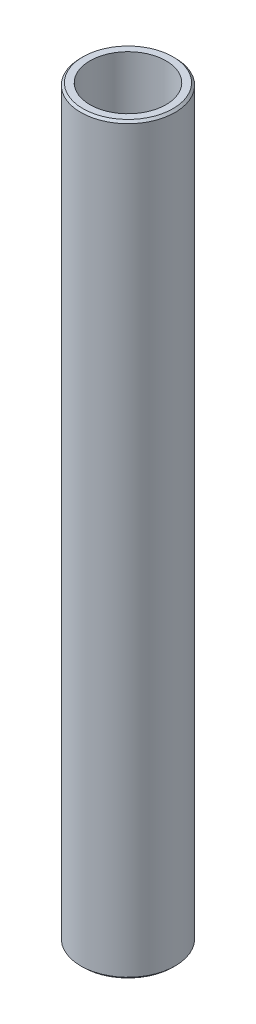
ISO-10303-21;
HEADER;
FILE_DESCRIPTION(('STEP AP214'),'2;1');
FILE_NAME('part.step','',(''),(''),'','','');
FILE_SCHEMA(('AUTOMOTIVE_DESIGN { 1 0 10303 214 1 1 1 1 }'));
ENDSEC;
DATA;
#1=APPLICATION_CONTEXT('core data for automotive mechanical design processes');
#2=APPLICATION_PROTOCOL_DEFINITION('international standard','automotive_design',2000,#1);
#3=PRODUCT_CONTEXT('',#1,'mechanical');
#4=PRODUCT('Part','Part','',(#3));
#5=PRODUCT_RELATED_PRODUCT_CATEGORY('part','',(#4));
#6=PRODUCT_DEFINITION_FORMATION('','',#4);
#7=PRODUCT_DEFINITION_CONTEXT('part definition',#1,'design');
#8=PRODUCT_DEFINITION('design','',#6,#7);
#9=PRODUCT_DEFINITION_SHAPE('','',#8);
#10=(LENGTH_UNIT() NAMED_UNIT(*) SI_UNIT(.MILLI.,.METRE.));
#11=(NAMED_UNIT(*) PLANE_ANGLE_UNIT() SI_UNIT($,.RADIAN.));
#12=(NAMED_UNIT(*) SI_UNIT($,.STERADIAN.) SOLID_ANGLE_UNIT());
#13=UNCERTAINTY_MEASURE_WITH_UNIT(LENGTH_MEASURE(1.E-05),#10,'distance_accuracy_value','');
#14=(GEOMETRIC_REPRESENTATION_CONTEXT(3) GLOBAL_UNCERTAINTY_ASSIGNED_CONTEXT((#13)) GLOBAL_UNIT_ASSIGNED_CONTEXT((#10,
#11,#12)) REPRESENTATION_CONTEXT('',''));
#15=CARTESIAN_POINT('',(0.,0.,0.));
#16=DIRECTION('',(0.,0.,1.));
#17=DIRECTION('',(1.,0.,0.));
#18=AXIS2_PLACEMENT_3D('',#15,#16,#17);
#19=CARTESIAN_POINT('',(0.,551.97195513698,0.));
#20=DIRECTION('',(0.,-1.,0.));
#21=DIRECTION('',(0.,0.,-1.));
#22=AXIS2_PLACEMENT_3D('',#19,#20,#21);
#23=CYLINDRICAL_SURFACE('',#22,35.);
#24=CARTESIAN_POINT('',(0.,550.366308495645,0.));
#25=DIRECTION('',(0.,1.,0.));
#26=DIRECTION('',(0.,0.,1.));
#27=AXIS2_PLACEMENT_3D('',#24,#25,#26);
#28=CIRCLE('',#27,35.);
#29=CARTESIAN_POINT('',(0.,550.366308495645,35.));
#30=VERTEX_POINT('',#29);
#31=EDGE_CURVE('E50',#30,#30,#28,.F.);
#32=ORIENTED_EDGE('',*,*,#31,.T.);
#33=EDGE_LOOP('',(#32));
#34=FACE_BOUND('',#33,.T.);
#35=CARTESIAN_POINT('',(0.,1.60564664133489,0.));
#36=DIRECTION('',(0.,1.,0.));
#37=DIRECTION('',(0.,0.,1.));
#38=AXIS2_PLACEMENT_3D('',#35,#36,#37);
#39=CIRCLE('',#38,35.);
#40=CARTESIAN_POINT('',(0.,1.60564664133489,35.));
#41=VERTEX_POINT('',#40);
#42=EDGE_CURVE('E51',#41,#41,#39,.T.);
#43=ORIENTED_EDGE('',*,*,#42,.T.);
#44=EDGE_LOOP('',(#43));
#45=FACE_BOUND('',#44,.T.);
#46=ADVANCED_FACE('F39',(#34,#45),#23,.T.);
#47=CARTESIAN_POINT('',(0.,551.97195513698,0.));
#48=DIRECTION('',(0.,1.,0.));
#49=DIRECTION('',(0.,0.,1.));
#50=AXIS2_PLACEMENT_3D('',#47,#48,#49);
#51=PLANE('',#50);
#52=CARTESIAN_POINT('',(0.,551.97195513698,0.));
#53=DIRECTION('',(0.,1.,0.));
#54=DIRECTION('',(0.,0.,1.));
#55=AXIS2_PLACEMENT_3D('',#52,#53,#54);
#56=CIRCLE('',#55,33.394353358665);
#57=CARTESIAN_POINT('',(0.,551.97195513698,33.394353358665));
#58=VERTEX_POINT('',#57);
#59=EDGE_CURVE('E54',#58,#58,#56,.T.);
#60=ORIENTED_EDGE('',*,*,#59,.T.);
#61=EDGE_LOOP('',(#60));
#62=FACE_BOUND('',#61,.T.);
#63=CARTESIAN_POINT('',(0.,551.97195513698,0.));
#64=DIRECTION('',(0.,1.,0.));
#65=DIRECTION('',(0.,0.,1.));
#66=AXIS2_PLACEMENT_3D('',#63,#64,#65);
#67=CIRCLE('',#66,28.2450713753402);
#68=CARTESIAN_POINT('',(0.,551.97195513698,28.2450713753402));
#69=VERTEX_POINT('',#68);
#70=EDGE_CURVE('E58',#69,#69,#67,.T.);
#71=ORIENTED_EDGE('',*,*,#70,.F.);
#72=EDGE_LOOP('',(#71));
#73=FACE_BOUND('',#72,.T.);
#74=ADVANCED_FACE('F69',(#62,#73),#51,.T.);
#75=CARTESIAN_POINT('',(0.,0.,0.));
#76=DIRECTION('',(0.,1.,0.));
#77=DIRECTION('',(0.,0.,1.));
#78=AXIS2_PLACEMENT_3D('',#75,#76,#77);
#79=PLANE('',#78);
#80=CARTESIAN_POINT('',(0.,0.,0.));
#81=DIRECTION('',(0.,1.,0.));
#82=DIRECTION('',(0.,0.,1.));
#83=AXIS2_PLACEMENT_3D('',#80,#81,#82);
#84=CIRCLE('',#83,33.394353358665);
#85=CARTESIAN_POINT('',(0.,0.,33.394353358665));
#86=VERTEX_POINT('',#85);
#87=EDGE_CURVE('E10',#86,#86,#84,.F.);
#88=ORIENTED_EDGE('',*,*,#87,.T.);
#89=EDGE_LOOP('',(#88));
#90=FACE_BOUND('',#89,.T.);
#91=CARTESIAN_POINT('',(0.,0.,0.));
#92=DIRECTION('',(0.,1.,0.));
#93=DIRECTION('',(0.,0.,1.));
#94=AXIS2_PLACEMENT_3D('',#91,#92,#93);
#95=CIRCLE('',#94,28.2450713753402);
#96=CARTESIAN_POINT('',(0.,0.,28.2450713753402));
#97=VERTEX_POINT('',#96);
#98=EDGE_CURVE('E63',#97,#97,#95,.T.);
#99=ORIENTED_EDGE('',*,*,#98,.T.);
#100=EDGE_LOOP('',(#99));
#101=FACE_BOUND('',#100,.T.);
#102=ADVANCED_FACE('F75',(#90,#101),#79,.F.);
#103=CARTESIAN_POINT('',(0.,551.97195513698,0.));
#104=DIRECTION('',(0.,-1.,0.));
#105=DIRECTION('',(0.,0.,-1.));
#106=AXIS2_PLACEMENT_3D('',#103,#104,#105);
#107=CYLINDRICAL_SURFACE('',#106,28.2450713753402);
#108=ORIENTED_EDGE('',*,*,#70,.T.);
#109=EDGE_LOOP('',(#108));
#110=FACE_BOUND('',#109,.T.);
#111=ORIENTED_EDGE('',*,*,#98,.F.);
#112=EDGE_LOOP('',(#111));
#113=FACE_BOUND('',#112,.T.);
#114=ADVANCED_FACE('F70',(#110,#113),#107,.F.);
#115=CARTESIAN_POINT('',(0.,551.97195513698,0.));
#116=DIRECTION('',(0.,-1.,0.));
#117=DIRECTION('',(0.,0.,-1.));
#118=AXIS2_PLACEMENT_3D('',#115,#116,#117);
#119=CONICAL_SURFACE('',#118,33.394353358665,0.785398163397407);
#120=ORIENTED_EDGE('',*,*,#31,.F.);
#121=EDGE_LOOP('',(#120));
#122=FACE_BOUND('',#121,.T.);
#123=ORIENTED_EDGE('',*,*,#59,.F.);
#124=EDGE_LOOP('',(#123));
#125=FACE_BOUND('',#124,.T.);
#126=ADVANCED_FACE('F81',(#122,#125),#119,.T.);
#127=CARTESIAN_POINT('',(0.,1.60564664133489,0.));
#128=DIRECTION('',(0.,1.,0.));
#129=DIRECTION('',(0.,0.,1.));
#130=AXIS2_PLACEMENT_3D('',#127,#128,#129);
#131=CONICAL_SURFACE('',#130,35.,0.785398163397476);
#132=ORIENTED_EDGE('',*,*,#87,.F.);
#133=EDGE_LOOP('',(#132));
#134=FACE_BOUND('',#133,.T.);
#135=ORIENTED_EDGE('',*,*,#42,.F.);
#136=EDGE_LOOP('',(#135));
#137=FACE_BOUND('',#136,.T.);
#138=ADVANCED_FACE('F45',(#134,#137),#131,.T.);
#139=CLOSED_SHELL('',(#46,#74,#102,#114,#126,#138));
#140=MANIFOLD_SOLID_BREP('B2',#139);
#141=ADVANCED_BREP_SHAPE_REPRESENTATION('',(#18,#140),#14);
#142=SHAPE_DEFINITION_REPRESENTATION(#9,#141);
ENDSEC;
END-ISO-10303-21;
